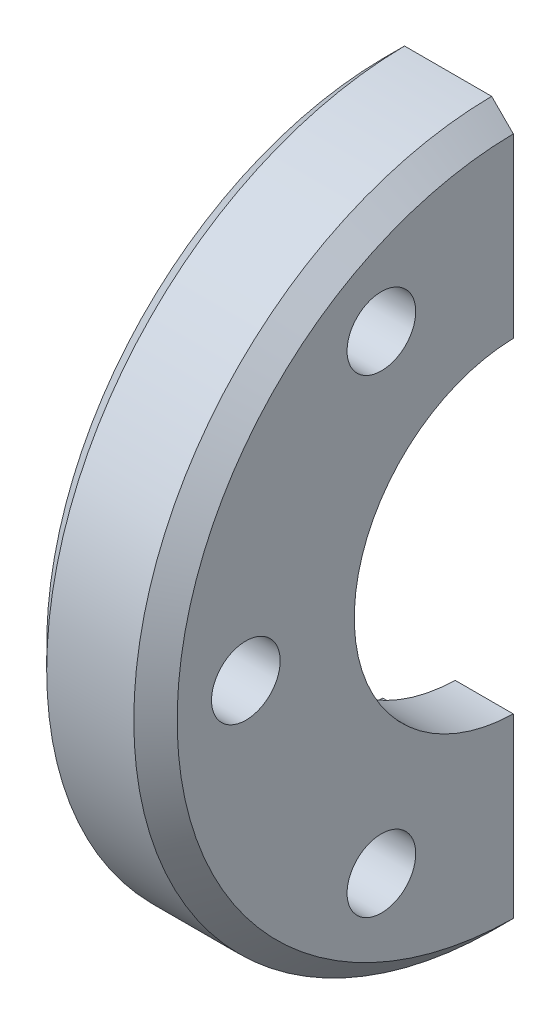
ISO-10303-21;
HEADER;
FILE_DESCRIPTION(('STEP AP214'),'2;1');
FILE_NAME('part.step','',(''),(''),'','','');
FILE_SCHEMA(('AUTOMOTIVE_DESIGN { 1 0 10303 214 1 1 1 1 }'));
ENDSEC;
DATA;
#1=APPLICATION_CONTEXT('core data for automotive mechanical design processes');
#2=APPLICATION_PROTOCOL_DEFINITION('international standard','automotive_design',2000,#1);
#3=PRODUCT_CONTEXT('',#1,'mechanical');
#4=PRODUCT('Part','Part','',(#3));
#5=PRODUCT_RELATED_PRODUCT_CATEGORY('part','',(#4));
#6=PRODUCT_DEFINITION_FORMATION('','',#4);
#7=PRODUCT_DEFINITION_CONTEXT('part definition',#1,'design');
#8=PRODUCT_DEFINITION('design','',#6,#7);
#9=PRODUCT_DEFINITION_SHAPE('','',#8);
#10=(LENGTH_UNIT() NAMED_UNIT(*) SI_UNIT(.MILLI.,.METRE.));
#11=(NAMED_UNIT(*) PLANE_ANGLE_UNIT() SI_UNIT($,.RADIAN.));
#12=(NAMED_UNIT(*) SI_UNIT($,.STERADIAN.) SOLID_ANGLE_UNIT());
#13=UNCERTAINTY_MEASURE_WITH_UNIT(LENGTH_MEASURE(1.E-05),#10,'distance_accuracy_value','');
#14=(GEOMETRIC_REPRESENTATION_CONTEXT(3) GLOBAL_UNCERTAINTY_ASSIGNED_CONTEXT((#13)) GLOBAL_UNIT_ASSIGNED_CONTEXT((#10,
#11,#12)) REPRESENTATION_CONTEXT('',''));
#15=CARTESIAN_POINT('',(0.,0.,0.));
#16=DIRECTION('',(0.,0.,1.));
#17=DIRECTION('',(1.,0.,0.));
#18=AXIS2_PLACEMENT_3D('',#15,#16,#17);
#19=CARTESIAN_POINT('',(1.524,0.,0.));
#20=DIRECTION('',(1.,0.,0.));
#21=DIRECTION('',(0.,0.,1.));
#22=AXIS2_PLACEMENT_3D('',#19,#20,#21);
#23=CONICAL_SURFACE('',#22,25.4,0.785398163397448);
#24=DIRECTION('',(-0.707089102412087,0.707124459519022,0.));
#25=VECTOR('',#24,1.);
#26=CARTESIAN_POINT('',(0.761999372515258,-24.6366900605422,0.254));
#27=LINE('',#26,#25);
#28=CARTESIAN_POINT('',(1.524,-25.3987299682484,0.254));
#29=VERTEX_POINT('',#28);
#30=CARTESIAN_POINT('',(0.,-23.8746488979419,0.254));
#31=VERTEX_POINT('',#30);
#32=EDGE_CURVE('E34',#29,#31,#27,.T.);
#33=ORIENTED_EDGE('',*,*,#32,.F.);
#34=CARTESIAN_POINT('',(1.524,0.,0.));
#35=DIRECTION('',(-1.,0.,0.));
#36=DIRECTION('',(0.,0.,-1.));
#37=AXIS2_PLACEMENT_3D('',#34,#35,#36);
#38=CIRCLE('',#37,25.4);
#39=CARTESIAN_POINT('',(1.524,25.3987299682484,0.254));
#40=VERTEX_POINT('',#39);
#41=EDGE_CURVE('E11',#29,#40,#38,.T.);
#42=ORIENTED_EDGE('',*,*,#41,.T.);
#43=DIRECTION('',(0.707086773354903,0.70712678845208,0.));
#44=VECTOR('',#43,1.);
#45=CARTESIAN_POINT('',(0.761999372513166,24.6366900605401,0.254));
#46=LINE('',#45,#44);
#47=CARTESIAN_POINT('',(0.,23.8746488979419,0.254));
#48=VERTEX_POINT('',#47);
#49=EDGE_CURVE('E134',#48,#40,#46,.T.);
#50=ORIENTED_EDGE('',*,*,#49,.F.);
#51=CARTESIAN_POINT('',(0.,0.,0.));
#52=DIRECTION('',(-1.,0.,0.));
#53=DIRECTION('',(0.,0.,-1.));
#54=AXIS2_PLACEMENT_3D('',#51,#52,#53);
#55=CIRCLE('',#54,23.876);
#56=EDGE_CURVE('E113',#31,#48,#55,.T.);
#57=ORIENTED_EDGE('',*,*,#56,.F.);
#58=EDGE_LOOP('',(#33,#42,#50,#57));
#59=FACE_BOUND('',#58,.T.);
#60=ADVANCED_FACE('F16',(#59),#23,.T.);
#61=CARTESIAN_POINT('',(9.1694,0.,0.));
#62=DIRECTION('',(-1.,0.,0.));
#63=DIRECTION('',(0.,0.,-1.));
#64=AXIS2_PLACEMENT_3D('',#61,#62,#63);
#65=CONICAL_SURFACE('',#64,23.876,0.785398163397448);
#66=DIRECTION('',(0.707089102412087,-0.707124459519022,0.));
#67=VECTOR('',#66,1.);
#68=CARTESIAN_POINT('',(8.40740062748475,24.6366900605421,0.254));
#69=LINE('',#68,#67);
#70=CARTESIAN_POINT('',(7.6454,25.3987299682484,0.254));
#71=VERTEX_POINT('',#70);
#72=CARTESIAN_POINT('',(9.1694,23.8746488979419,0.254));
#73=VERTEX_POINT('',#72);
#74=EDGE_CURVE('E20',#71,#73,#69,.T.);
#75=ORIENTED_EDGE('',*,*,#74,.F.);
#76=CARTESIAN_POINT('',(7.6454,0.,0.));
#77=DIRECTION('',(-1.,0.,0.));
#78=DIRECTION('',(0.,0.,-1.));
#79=AXIS2_PLACEMENT_3D('',#76,#77,#78);
#80=CIRCLE('',#79,25.4);
#81=CARTESIAN_POINT('',(7.6454,-25.3987299682484,0.254));
#82=VERTEX_POINT('',#81);
#83=EDGE_CURVE('E114',#82,#71,#80,.T.);
#84=ORIENTED_EDGE('',*,*,#83,.F.);
#85=DIRECTION('',(-0.707086773354906,-0.707126788452077,0.));
#86=VECTOR('',#85,1.);
#87=CARTESIAN_POINT('',(8.40740062748683,-24.6366900605401,0.254));
#88=LINE('',#87,#86);
#89=CARTESIAN_POINT('',(9.1694,-23.8746488979419,0.254));
#90=VERTEX_POINT('',#89);
#91=EDGE_CURVE('E128',#90,#82,#88,.T.);
#92=ORIENTED_EDGE('',*,*,#91,.F.);
#93=CARTESIAN_POINT('',(9.1694,0.,0.));
#94=DIRECTION('',(-1.,0.,0.));
#95=DIRECTION('',(0.,0.,-1.));
#96=AXIS2_PLACEMENT_3D('',#93,#94,#95);
#97=CIRCLE('',#96,23.876);
#98=EDGE_CURVE('E26',#90,#73,#97,.T.);
#99=ORIENTED_EDGE('',*,*,#98,.T.);
#100=EDGE_LOOP('',(#75,#84,#92,#99));
#101=FACE_BOUND('',#100,.T.);
#102=ADVANCED_FACE('F190',(#101),#65,.T.);
#103=CARTESIAN_POINT('',(-50.8,-50.8,0.254));
#104=DIRECTION('',(0.,0.,-1.));
#105=DIRECTION('',(1.,0.,0.));
#106=AXIS2_PLACEMENT_3D('',#103,#104,#105);
#107=PLANE('',#106);
#108=DIRECTION('',(1.,0.,0.));
#109=VECTOR('',#108,1.);
#110=CARTESIAN_POINT('',(9.1694,-15.047356387419,0.254));
#111=LINE('',#110,#109);
#112=CARTESIAN_POINT('',(0.,-15.047356387419,0.254));
#113=VERTEX_POINT('',#112);
#114=CARTESIAN_POINT('',(4.1101578979956,-15.047356387419,0.254));
#115=VERTEX_POINT('',#114);
#116=EDGE_CURVE('E163',#113,#115,#111,.T.);
#117=ORIENTED_EDGE('',*,*,#116,.T.);
#118=CARTESIAN_POINT('',(4.11015789799561,-15.047356387419,0.254));
#119=CARTESIAN_POINT('',(4.43345221536625,-13.8406336866748,0.254));
#120=CARTESIAN_POINT('',(4.75673722811473,-12.6339085132271,0.254));
#121=CARTESIAN_POINT('',(5.08,-11.4271774292692,0.254));
#122=B_SPLINE_CURVE_WITH_KNOTS('',3,(#118,#119,#120,#121),.UNSPECIFIED.,.F.,.F.,(4,4),
(0.0187084762179341,0.0224563066389064),.UNSPECIFIED.);
#123=CARTESIAN_POINT('',(5.08,-11.4271774292692,0.254));
#124=VERTEX_POINT('',#123);
#125=EDGE_CURVE('E166',#115,#124,#122,.T.);
#126=ORIENTED_EDGE('',*,*,#125,.T.);
#127=DIRECTION('',(1.,0.,0.));
#128=VECTOR('',#127,1.);
#129=CARTESIAN_POINT('',(9.1694,-11.4271774292692,0.254));
#130=LINE('',#129,#128);
#131=CARTESIAN_POINT('',(9.1694,-11.4271774292692,0.254));
#132=VERTEX_POINT('',#131);
#133=EDGE_CURVE('E102',#124,#132,#130,.T.);
#134=ORIENTED_EDGE('',*,*,#133,.T.);
#135=DIRECTION('',(0.,-1.,0.));
#136=VECTOR('',#135,1.);
#137=CARTESIAN_POINT('',(9.1694,-11.43,0.254));
#138=LINE('',#137,#136);
#139=EDGE_CURVE('E131',#132,#90,#138,.T.);
#140=ORIENTED_EDGE('',*,*,#139,.T.);
#141=ORIENTED_EDGE('',*,*,#91,.T.);
#142=DIRECTION('',(-1.,0.,0.));
#143=VECTOR('',#142,1.);
#144=CARTESIAN_POINT('',(9.1694,-25.3987299682484,0.254));
#145=LINE('',#144,#143);
#146=EDGE_CURVE('E132',#82,#29,#145,.T.);
#147=ORIENTED_EDGE('',*,*,#146,.T.);
#148=ORIENTED_EDGE('',*,*,#32,.T.);
#149=DIRECTION('',(0.,1.,0.));
#150=VECTOR('',#149,1.);
#151=CARTESIAN_POINT('',(0.,-23.876,0.254));
#152=LINE('',#151,#150);
#153=EDGE_CURVE('E133',#31,#113,#152,.T.);
#154=ORIENTED_EDGE('',*,*,#153,.T.);
#155=EDGE_LOOP('',(#117,#126,#134,#140,#141,#147,#148,#154));
#156=FACE_BOUND('',#155,.T.);
#157=ADVANCED_FACE('F184',(#156),#107,.T.);
#158=CARTESIAN_POINT('',(-50.8,-50.8,0.254));
#159=DIRECTION('',(0.,0.,-1.));
#160=DIRECTION('',(1.,0.,0.));
#161=AXIS2_PLACEMENT_3D('',#158,#159,#160);
#162=PLANE('',#161);
#163=DIRECTION('',(-1.,0.,0.));
#164=VECTOR('',#163,1.);
#165=CARTESIAN_POINT('',(9.1694,15.047356387419,0.254));
#166=LINE('',#165,#164);
#167=CARTESIAN_POINT('',(4.1101578979956,15.047356387419,0.254));
#168=VERTEX_POINT('',#167);
#169=CARTESIAN_POINT('',(0.,15.047356387419,0.254));
#170=VERTEX_POINT('',#169);
#171=EDGE_CURVE('E140',#168,#170,#166,.T.);
#172=ORIENTED_EDGE('',*,*,#171,.T.);
#173=DIRECTION('',(0.,1.,0.));
#174=VECTOR('',#173,1.);
#175=CARTESIAN_POINT('',(0.,-23.876,0.254));
#176=LINE('',#175,#174);
#177=EDGE_CURVE('E135',#170,#48,#176,.T.);
#178=ORIENTED_EDGE('',*,*,#177,.T.);
#179=ORIENTED_EDGE('',*,*,#49,.T.);
#180=DIRECTION('',(1.,0.,0.));
#181=VECTOR('',#180,1.);
#182=CARTESIAN_POINT('',(9.1694,25.3987299682484,0.254));
#183=LINE('',#182,#181);
#184=EDGE_CURVE('E136',#40,#71,#183,.T.);
#185=ORIENTED_EDGE('',*,*,#184,.T.);
#186=ORIENTED_EDGE('',*,*,#74,.T.);
#187=DIRECTION('',(0.,-1.,0.));
#188=VECTOR('',#187,1.);
#189=CARTESIAN_POINT('',(9.1694,-11.43,0.254));
#190=LINE('',#189,#188);
#191=CARTESIAN_POINT('',(9.1694,11.4271774292692,0.254));
#192=VERTEX_POINT('',#191);
#193=EDGE_CURVE('E97',#73,#192,#190,.T.);
#194=ORIENTED_EDGE('',*,*,#193,.T.);
#195=DIRECTION('',(-1.,0.,0.));
#196=VECTOR('',#195,1.);
#197=CARTESIAN_POINT('',(9.1694,11.4271774292692,0.254));
#198=LINE('',#197,#196);
#199=CARTESIAN_POINT('',(5.08,11.4271774292692,0.254));
#200=VERTEX_POINT('',#199);
#201=EDGE_CURVE('E79',#192,#200,#198,.T.);
#202=ORIENTED_EDGE('',*,*,#201,.T.);
#203=CARTESIAN_POINT('',(5.08,11.4271774292692,0.254));
#204=CARTESIAN_POINT('',(4.75673722679854,12.6339085181404,0.254));
#205=CARTESIAN_POINT('',(4.43345221436652,13.8406336904064,0.254));
#206=CARTESIAN_POINT('',(4.11015789799561,15.047356387419,0.254));
#207=B_SPLINE_CURVE_WITH_KNOTS('',3,(#203,#204,#205,#206),.UNSPECIFIED.,.F.,.F.,(4,4),
(0.0459629505750064,0.0496729072252077),.UNSPECIFIED.);
#208=EDGE_CURVE('E85',#200,#168,#207,.T.);
#209=ORIENTED_EDGE('',*,*,#208,.T.);
#210=EDGE_LOOP('',(#172,#178,#179,#185,#186,#194,#202,#209));
#211=FACE_BOUND('',#210,.T.);
#212=ADVANCED_FACE('F95',(#211),#162,.T.);
#213=CARTESIAN_POINT('',(9.1694,16.497783942094,9.525));
#214=DIRECTION('',(1.,0.,0.));
#215=DIRECTION('',(0.,0.,-1.));
#216=AXIS2_PLACEMENT_3D('',#213,#214,#215);
#217=CYLINDRICAL_SURFACE('',#216,2.413);
#218=CARTESIAN_POINT('',(9.1694,16.497783942094,9.525));
#219=DIRECTION('',(1.,0.,0.));
#220=DIRECTION('',(0.,-1.,0.));
#221=AXIS2_PLACEMENT_3D('',#218,#219,#220);
#222=CIRCLE('',#221,2.413);
#223=CARTESIAN_POINT('',(9.1694,14.084783942094,9.525));
#224=VERTEX_POINT('',#223);
#225=EDGE_CURVE('E93',#224,#224,#222,.T.);
#226=ORIENTED_EDGE('',*,*,#225,.T.);
#227=EDGE_LOOP('',(#226));
#228=FACE_BOUND('',#227,.T.);
#229=CARTESIAN_POINT('',(0.,16.497783942094,9.525));
#230=DIRECTION('',(1.,0.,0.));
#231=DIRECTION('',(0.,-1.,0.));
#232=AXIS2_PLACEMENT_3D('',#229,#230,#231);
#233=CIRCLE('',#232,2.413);
#234=CARTESIAN_POINT('',(0.,14.084783942094,9.525));
#235=VERTEX_POINT('',#234);
#236=EDGE_CURVE('E121',#235,#235,#233,.T.);
#237=ORIENTED_EDGE('',*,*,#236,.F.);
#238=EDGE_LOOP('',(#237));
#239=FACE_BOUND('',#238,.T.);
#240=ADVANCED_FACE('F203',(#228,#239),#217,.F.);
#241=CARTESIAN_POINT('',(4.1101578979956,0.,0.));
#242=DIRECTION('',(-1.,0.,0.));
#243=DIRECTION('',(0.,0.,-1.));
#244=AXIS2_PLACEMENT_3D('',#241,#242,#243);
#245=CONICAL_SURFACE('',#244,15.0495,1.30899693899576);
#246=ORIENTED_EDGE('',*,*,#125,.F.);
#247=CARTESIAN_POINT('',(4.1101578979956,0.,0.));
#248=DIRECTION('',(-1.,0.,0.));
#249=DIRECTION('',(0.,0.,-1.));
#250=AXIS2_PLACEMENT_3D('',#247,#248,#249);
#251=CIRCLE('',#250,15.0495);
#252=EDGE_CURVE('E89',#115,#168,#251,.T.);
#253=ORIENTED_EDGE('',*,*,#252,.T.);
#254=ORIENTED_EDGE('',*,*,#208,.F.);
#255=CARTESIAN_POINT('',(5.08,0.,0.));
#256=DIRECTION('',(-1.,0.,0.));
#257=DIRECTION('',(0.,0.,-1.));
#258=AXIS2_PLACEMENT_3D('',#255,#256,#257);
#259=CIRCLE('',#258,11.43);
#260=EDGE_CURVE('E87',#124,#200,#259,.T.);
#261=ORIENTED_EDGE('',*,*,#260,.F.);
#262=EDGE_LOOP('',(#246,#253,#254,#261));
#263=FACE_BOUND('',#262,.T.);
#264=ADVANCED_FACE('F86',(#263),#245,.F.);
#265=CARTESIAN_POINT('',(9.1694,0.,0.));
#266=DIRECTION('',(1.,0.,0.));
#267=DIRECTION('',(0.,0.,-1.));
#268=AXIS2_PLACEMENT_3D('',#265,#266,#267);
#269=CYLINDRICAL_SURFACE('',#268,11.43);
#270=ORIENTED_EDGE('',*,*,#133,.F.);
#271=ORIENTED_EDGE('',*,*,#260,.T.);
#272=ORIENTED_EDGE('',*,*,#201,.F.);
#273=CARTESIAN_POINT('',(9.1694,0.,0.));
#274=DIRECTION('',(-1.,0.,0.));
#275=DIRECTION('',(0.,0.,-1.));
#276=AXIS2_PLACEMENT_3D('',#273,#274,#275);
#277=CIRCLE('',#276,11.43);
#278=EDGE_CURVE('E112',#132,#192,#277,.T.);
#279=ORIENTED_EDGE('',*,*,#278,.F.);
#280=EDGE_LOOP('',(#270,#271,#272,#279));
#281=FACE_BOUND('',#280,.T.);
#282=ADVANCED_FACE('F100',(#281),#269,.F.);
#283=CARTESIAN_POINT('',(9.1694,0.,0.));
#284=DIRECTION('',(1.,0.,0.));
#285=DIRECTION('',(0.,0.,-1.));
#286=AXIS2_PLACEMENT_3D('',#283,#284,#285);
#287=CYLINDRICAL_SURFACE('',#286,15.0495);
#288=ORIENTED_EDGE('',*,*,#116,.F.);
#289=CARTESIAN_POINT('',(0.,0.,0.));
#290=DIRECTION('',(-1.,0.,0.));
#291=DIRECTION('',(0.,0.,-1.));
#292=AXIS2_PLACEMENT_3D('',#289,#290,#291);
#293=CIRCLE('',#292,15.0495);
#294=EDGE_CURVE('E104',#113,#170,#293,.T.);
#295=ORIENTED_EDGE('',*,*,#294,.T.);
#296=ORIENTED_EDGE('',*,*,#171,.F.);
#297=ORIENTED_EDGE('',*,*,#252,.F.);
#298=EDGE_LOOP('',(#288,#295,#296,#297));
#299=FACE_BOUND('',#298,.T.);
#300=ADVANCED_FACE('F181',(#299),#287,.F.);
#301=CARTESIAN_POINT('',(0.,-23.876,0.));
#302=DIRECTION('',(1.,0.,0.));
#303=DIRECTION('',(0.,0.,1.));
#304=AXIS2_PLACEMENT_3D('',#301,#302,#303);
#305=PLANE('',#304);
#306=CARTESIAN_POINT('',(0.,0.,19.05));
#307=DIRECTION('',(1.,0.,0.));
#308=DIRECTION('',(0.,-1.,0.));
#309=AXIS2_PLACEMENT_3D('',#306,#307,#308);
#310=CIRCLE('',#309,2.413);
#311=CARTESIAN_POINT('',(0.,-2.41299999999999,19.05));
#312=VERTEX_POINT('',#311);
#313=EDGE_CURVE('E108',#312,#312,#310,.T.);
#314=ORIENTED_EDGE('',*,*,#313,.T.);
#315=EDGE_LOOP('',(#314));
#316=FACE_BOUND('',#315,.T.);
#317=CARTESIAN_POINT('',(0.,-16.497783942094,9.525));
#318=DIRECTION('',(1.,0.,0.));
#319=DIRECTION('',(0.,-1.,0.));
#320=AXIS2_PLACEMENT_3D('',#317,#318,#319);
#321=CIRCLE('',#320,2.413);
#322=CARTESIAN_POINT('',(0.,-18.910783942094,9.525));
#323=VERTEX_POINT('',#322);
#324=EDGE_CURVE('E118',#323,#323,#321,.T.);
#325=ORIENTED_EDGE('',*,*,#324,.T.);
#326=EDGE_LOOP('',(#325));
#327=FACE_BOUND('',#326,.T.);
#328=ORIENTED_EDGE('',*,*,#236,.T.);
#329=EDGE_LOOP('',(#328));
#330=FACE_BOUND('',#329,.T.);
#331=ORIENTED_EDGE('',*,*,#153,.F.);
#332=ORIENTED_EDGE('',*,*,#56,.T.);
#333=ORIENTED_EDGE('',*,*,#177,.F.);
#334=ORIENTED_EDGE('',*,*,#294,.F.);
#335=EDGE_LOOP('',(#331,#332,#333,#334));
#336=FACE_BOUND('',#335,.T.);
#337=ADVANCED_FACE('F182',(#316,#327,#330,#336),#305,.F.);
#338=CARTESIAN_POINT('',(9.1694,-11.43,0.));
#339=DIRECTION('',(-1.,0.,0.));
#340=DIRECTION('',(0.,0.,-1.));
#341=AXIS2_PLACEMENT_3D('',#338,#339,#340);
#342=PLANE('',#341);
#343=CARTESIAN_POINT('',(9.1694,0.,19.05));
#344=DIRECTION('',(1.,0.,0.));
#345=DIRECTION('',(0.,-1.,0.));
#346=AXIS2_PLACEMENT_3D('',#343,#344,#345);
#347=CIRCLE('',#346,2.413);
#348=CARTESIAN_POINT('',(9.1694,-2.41299999999999,19.05));
#349=VERTEX_POINT('',#348);
#350=EDGE_CURVE('E122',#349,#349,#347,.T.);
#351=ORIENTED_EDGE('',*,*,#350,.F.);
#352=EDGE_LOOP('',(#351));
#353=FACE_BOUND('',#352,.T.);
#354=CARTESIAN_POINT('',(9.1694,-16.497783942094,9.525));
#355=DIRECTION('',(1.,0.,0.));
#356=DIRECTION('',(0.,-1.,0.));
#357=AXIS2_PLACEMENT_3D('',#354,#355,#356);
#358=CIRCLE('',#357,2.413);
#359=CARTESIAN_POINT('',(9.1694,-18.910783942094,9.525));
#360=VERTEX_POINT('',#359);
#361=EDGE_CURVE('E125',#360,#360,#358,.T.);
#362=ORIENTED_EDGE('',*,*,#361,.F.);
#363=EDGE_LOOP('',(#362));
#364=FACE_BOUND('',#363,.T.);
#365=ORIENTED_EDGE('',*,*,#225,.F.);
#366=EDGE_LOOP('',(#365));
#367=FACE_BOUND('',#366,.T.);
#368=ORIENTED_EDGE('',*,*,#193,.F.);
#369=ORIENTED_EDGE('',*,*,#98,.F.);
#370=ORIENTED_EDGE('',*,*,#139,.F.);
#371=ORIENTED_EDGE('',*,*,#278,.T.);
#372=EDGE_LOOP('',(#368,#369,#370,#371));
#373=FACE_BOUND('',#372,.T.);
#374=ADVANCED_FACE('F215',(#353,#364,#367,#373),#342,.F.);
#375=CARTESIAN_POINT('',(9.1694,0.,0.));
#376=DIRECTION('',(1.,0.,0.));
#377=DIRECTION('',(0.,0.,-1.));
#378=AXIS2_PLACEMENT_3D('',#375,#376,#377);
#379=CYLINDRICAL_SURFACE('',#378,25.4);
#380=ORIENTED_EDGE('',*,*,#146,.F.);
#381=ORIENTED_EDGE('',*,*,#83,.T.);
#382=ORIENTED_EDGE('',*,*,#184,.F.);
#383=ORIENTED_EDGE('',*,*,#41,.F.);
#384=EDGE_LOOP('',(#380,#381,#382,#383));
#385=FACE_BOUND('',#384,.T.);
#386=ADVANCED_FACE('F187',(#385),#379,.T.);
#387=CARTESIAN_POINT('',(9.1694,-16.497783942094,9.525));
#388=DIRECTION('',(1.,0.,0.));
#389=DIRECTION('',(0.,0.,-1.));
#390=AXIS2_PLACEMENT_3D('',#387,#388,#389);
#391=CYLINDRICAL_SURFACE('',#390,2.413);
#392=ORIENTED_EDGE('',*,*,#361,.T.);
#393=EDGE_LOOP('',(#392));
#394=FACE_BOUND('',#393,.T.);
#395=ORIENTED_EDGE('',*,*,#324,.F.);
#396=EDGE_LOOP('',(#395));
#397=FACE_BOUND('',#396,.T.);
#398=ADVANCED_FACE('F221',(#394,#397),#391,.F.);
#399=CARTESIAN_POINT('',(9.1694,0.,19.05));
#400=DIRECTION('',(1.,0.,0.));
#401=DIRECTION('',(0.,0.,-1.));
#402=AXIS2_PLACEMENT_3D('',#399,#400,#401);
#403=CYLINDRICAL_SURFACE('',#402,2.413);
#404=ORIENTED_EDGE('',*,*,#350,.T.);
#405=EDGE_LOOP('',(#404));
#406=FACE_BOUND('',#405,.T.);
#407=ORIENTED_EDGE('',*,*,#313,.F.);
#408=EDGE_LOOP('',(#407));
#409=FACE_BOUND('',#408,.T.);
#410=ADVANCED_FACE('F18',(#406,#409),#403,.F.);
#411=CLOSED_SHELL('',(#60,#102,#157,#212,#240,#264,#282,#300,#337,#374,#386,#398,#410));
#412=MANIFOLD_SOLID_BREP('B1',#411);
#413=ADVANCED_BREP_SHAPE_REPRESENTATION('',(#18,#412),#14);
#414=SHAPE_DEFINITION_REPRESENTATION(#9,#413);
ENDSEC;
END-ISO-10303-21;
